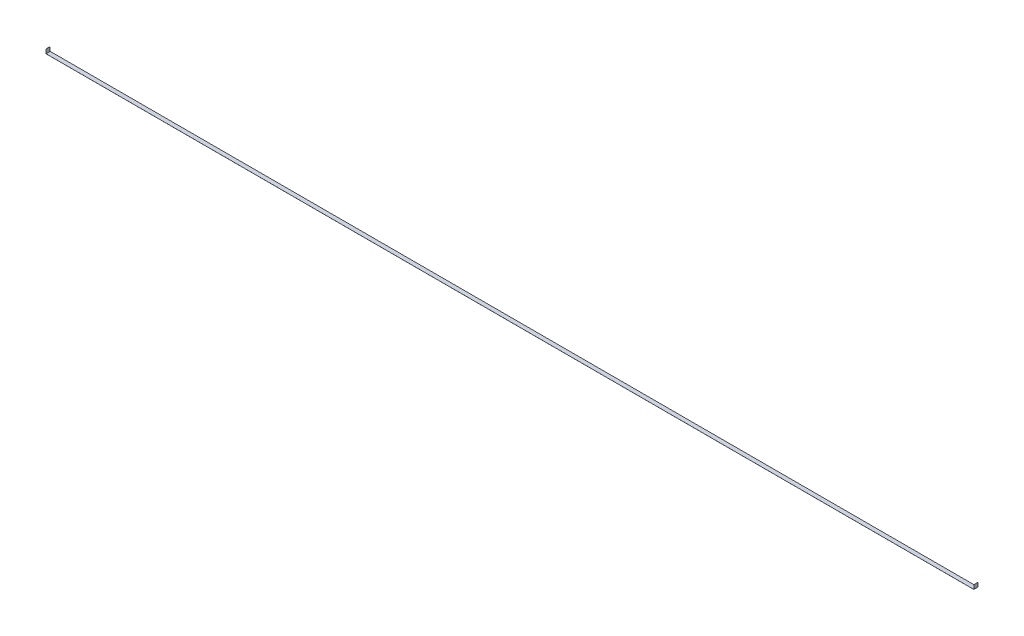
ISO-10303-21;
HEADER;
FILE_DESCRIPTION(('STEP AP214'),'2;1');
FILE_NAME('part.step','',(''),(''),'','','');
FILE_SCHEMA(('AUTOMOTIVE_DESIGN { 1 0 10303 214 1 1 1 1 }'));
ENDSEC;
DATA;
#1=APPLICATION_CONTEXT('core data for automotive mechanical design processes');
#2=APPLICATION_PROTOCOL_DEFINITION('international standard','automotive_design',2000,#1);
#3=PRODUCT_CONTEXT('',#1,'mechanical');
#4=PRODUCT('Part','Part','',(#3));
#5=PRODUCT_RELATED_PRODUCT_CATEGORY('part','',(#4));
#6=PRODUCT_DEFINITION_FORMATION('','',#4);
#7=PRODUCT_DEFINITION_CONTEXT('part definition',#1,'design');
#8=PRODUCT_DEFINITION('design','',#6,#7);
#9=PRODUCT_DEFINITION_SHAPE('','',#8);
#10=(LENGTH_UNIT() NAMED_UNIT(*) SI_UNIT(.MILLI.,.METRE.));
#11=(NAMED_UNIT(*) PLANE_ANGLE_UNIT() SI_UNIT($,.RADIAN.));
#12=(NAMED_UNIT(*) SI_UNIT($,.STERADIAN.) SOLID_ANGLE_UNIT());
#13=UNCERTAINTY_MEASURE_WITH_UNIT(LENGTH_MEASURE(1.E-05),#10,'distance_accuracy_value','');
#14=(GEOMETRIC_REPRESENTATION_CONTEXT(3) GLOBAL_UNCERTAINTY_ASSIGNED_CONTEXT((#13)) GLOBAL_UNIT_ASSIGNED_CONTEXT((#10,
#11,#12)) REPRESENTATION_CONTEXT('',''));
#15=CARTESIAN_POINT('',(0.,0.,0.));
#16=DIRECTION('',(0.,0.,1.));
#17=DIRECTION('',(1.,0.,0.));
#18=AXIS2_PLACEMENT_3D('',#15,#16,#17);
#19=CARTESIAN_POINT('',(2832.354,1.04049665995957E-12,12.7));
#20=DIRECTION('',(-1.,0.,0.));
#21=DIRECTION('',(0.,0.,1.));
#22=AXIS2_PLACEMENT_3D('',#19,#20,#21);
#23=PLANE('',#22);
#24=DIRECTION('',(0.,1.,0.));
#25=VECTOR('',#24,1.);
#26=CARTESIAN_POINT('',(2832.354,1.04049665995957E-12,-12.7));
#27=LINE('',#26,#25);
#28=CARTESIAN_POINT('',(2832.354,-0.253999999998959,-12.7));
#29=VERTEX_POINT('',#28);
#30=CARTESIAN_POINT('',(2832.354,25.400000000001,-12.7));
#31=VERTEX_POINT('',#30);
#32=EDGE_CURVE('E134',#29,#31,#27,.T.);
#33=ORIENTED_EDGE('',*,*,#32,.T.);
#34=DIRECTION('',(0.,0.,-1.));
#35=VECTOR('',#34,1.);
#36=CARTESIAN_POINT('',(2832.354,25.400000000001,12.7));
#37=LINE('',#36,#35);
#38=CARTESIAN_POINT('',(2832.354,25.400000000001,12.7));
#39=VERTEX_POINT('',#38);
#40=EDGE_CURVE('E11',#39,#31,#37,.T.);
#41=ORIENTED_EDGE('',*,*,#40,.F.);
#42=DIRECTION('',(0.,1.,0.));
#43=VECTOR('',#42,1.);
#44=CARTESIAN_POINT('',(2832.354,1.04049665995957E-12,12.7));
#45=LINE('',#44,#43);
#46=CARTESIAN_POINT('',(2832.354,-0.253999999998959,12.7));
#47=VERTEX_POINT('',#46);
#48=EDGE_CURVE('E92',#47,#39,#45,.T.);
#49=ORIENTED_EDGE('',*,*,#48,.F.);
#50=DIRECTION('',(0.,0.,-1.));
#51=VECTOR('',#50,1.);
#52=CARTESIAN_POINT('',(2832.354,-0.253999999998959,12.7));
#53=LINE('',#52,#51);
#54=EDGE_CURVE('E133',#47,#29,#53,.T.);
#55=ORIENTED_EDGE('',*,*,#54,.T.);
#56=EDGE_LOOP('',(#33,#41,#49,#55));
#57=FACE_BOUND('',#56,.T.);
#58=ADVANCED_FACE('F37',(#57),#23,.F.);
#59=CARTESIAN_POINT('',(2832.1,25.400000000001,12.7));
#60=DIRECTION('',(0.,1.,0.));
#61=DIRECTION('',(0.,0.,1.));
#62=AXIS2_PLACEMENT_3D('',#59,#60,#61);
#63=PLANE('',#62);
#64=DIRECTION('',(1.,0.,0.));
#65=VECTOR('',#64,1.);
#66=CARTESIAN_POINT('',(2832.1,25.400000000001,-12.7));
#67=LINE('',#66,#65);
#68=CARTESIAN_POINT('',(2832.1,25.400000000001,-12.7));
#69=VERTEX_POINT('',#68);
#70=EDGE_CURVE('E137',#69,#31,#67,.T.);
#71=ORIENTED_EDGE('',*,*,#70,.F.);
#72=DIRECTION('',(0.,0.,-1.));
#73=VECTOR('',#72,1.);
#74=CARTESIAN_POINT('',(2832.1,25.400000000001,12.7));
#75=LINE('',#74,#73);
#76=CARTESIAN_POINT('',(2832.1,25.400000000001,12.7));
#77=VERTEX_POINT('',#76);
#78=EDGE_CURVE('E45',#77,#69,#75,.T.);
#79=ORIENTED_EDGE('',*,*,#78,.F.);
#80=DIRECTION('',(1.,0.,0.));
#81=VECTOR('',#80,1.);
#82=CARTESIAN_POINT('',(2832.1,25.400000000001,12.7));
#83=LINE('',#82,#81);
#84=EDGE_CURVE('E176',#77,#39,#83,.T.);
#85=ORIENTED_EDGE('',*,*,#84,.T.);
#86=ORIENTED_EDGE('',*,*,#40,.T.);
#87=EDGE_LOOP('',(#71,#79,#85,#86));
#88=FACE_BOUND('',#87,.T.);
#89=ADVANCED_FACE('F167',(#88),#63,.T.);
#90=CARTESIAN_POINT('',(2832.1,1.04049665995957E-12,12.7));
#91=DIRECTION('',(-1.,0.,0.));
#92=DIRECTION('',(0.,0.,1.));
#93=AXIS2_PLACEMENT_3D('',#90,#91,#92);
#94=PLANE('',#93);
#95=DIRECTION('',(0.,1.,0.));
#96=VECTOR('',#95,1.);
#97=CARTESIAN_POINT('',(2832.1,1.04049665995957E-12,-12.7));
#98=LINE('',#97,#96);
#99=CARTESIAN_POINT('',(2832.1,1.04049665995957E-12,-12.7));
#100=VERTEX_POINT('',#99);
#101=EDGE_CURVE('E140',#100,#69,#98,.T.);
#102=ORIENTED_EDGE('',*,*,#101,.F.);
#103=DIRECTION('',(0.,0.,-1.));
#104=VECTOR('',#103,1.);
#105=CARTESIAN_POINT('',(2832.1,1.04049665995957E-12,12.7));
#106=LINE('',#105,#104);
#107=CARTESIAN_POINT('',(2832.1,1.04049665995957E-12,12.7));
#108=VERTEX_POINT('',#107);
#109=EDGE_CURVE('E157',#108,#100,#106,.T.);
#110=ORIENTED_EDGE('',*,*,#109,.F.);
#111=DIRECTION('',(0.,1.,0.));
#112=VECTOR('',#111,1.);
#113=CARTESIAN_POINT('',(2832.1,1.04049665995957E-12,12.7));
#114=LINE('',#113,#112);
#115=EDGE_CURVE('E164',#108,#77,#114,.T.);
#116=ORIENTED_EDGE('',*,*,#115,.T.);
#117=ORIENTED_EDGE('',*,*,#78,.T.);
#118=EDGE_LOOP('',(#102,#110,#116,#117));
#119=FACE_BOUND('',#118,.T.);
#120=ADVANCED_FACE('F162',(#119),#94,.T.);
#121=CARTESIAN_POINT('',(-2832.1,0.,12.7));
#122=DIRECTION('',(0.,1.,0.));
#123=DIRECTION('',(-1.,0.,0.));
#124=AXIS2_PLACEMENT_3D('',#121,#122,#123);
#125=PLANE('',#124);
#126=DIRECTION('',(1.,0.,0.));
#127=VECTOR('',#126,1.);
#128=CARTESIAN_POINT('',(-2832.1,0.,-12.7));
#129=LINE('',#128,#127);
#130=CARTESIAN_POINT('',(-2832.1,0.,-12.7));
#131=VERTEX_POINT('',#130);
#132=EDGE_CURVE('E143',#131,#100,#129,.T.);
#133=ORIENTED_EDGE('',*,*,#132,.F.);
#134=DIRECTION('',(0.,0.,-1.));
#135=VECTOR('',#134,1.);
#136=CARTESIAN_POINT('',(-2832.1,0.,12.7));
#137=LINE('',#136,#135);
#138=CARTESIAN_POINT('',(-2832.1,0.,12.7));
#139=VERTEX_POINT('',#138);
#140=EDGE_CURVE('E155',#139,#131,#137,.T.);
#141=ORIENTED_EDGE('',*,*,#140,.F.);
#142=DIRECTION('',(1.,0.,0.));
#143=VECTOR('',#142,1.);
#144=CARTESIAN_POINT('',(-2832.1,0.,12.7));
#145=LINE('',#144,#143);
#146=EDGE_CURVE('E128',#139,#108,#145,.T.);
#147=ORIENTED_EDGE('',*,*,#146,.T.);
#148=ORIENTED_EDGE('',*,*,#109,.T.);
#149=EDGE_LOOP('',(#133,#141,#147,#148));
#150=FACE_BOUND('',#149,.T.);
#151=ADVANCED_FACE('F174',(#150),#125,.T.);
#152=CARTESIAN_POINT('',(-2832.1,25.4,12.7));
#153=DIRECTION('',(1.,0.,0.));
#154=DIRECTION('',(0.,0.,-1.));
#155=AXIS2_PLACEMENT_3D('',#152,#153,#154);
#156=PLANE('',#155);
#157=DIRECTION('',(0.,-1.,0.));
#158=VECTOR('',#157,1.);
#159=CARTESIAN_POINT('',(-2832.1,25.4,-12.7));
#160=LINE('',#159,#158);
#161=CARTESIAN_POINT('',(-2832.1,25.4,-12.7));
#162=VERTEX_POINT('',#161);
#163=EDGE_CURVE('E146',#162,#131,#160,.T.);
#164=ORIENTED_EDGE('',*,*,#163,.F.);
#165=DIRECTION('',(0.,0.,-1.));
#166=VECTOR('',#165,1.);
#167=CARTESIAN_POINT('',(-2832.1,25.4,12.7));
#168=LINE('',#167,#166);
#169=CARTESIAN_POINT('',(-2832.1,25.4,12.7));
#170=VERTEX_POINT('',#169);
#171=EDGE_CURVE('E116',#170,#162,#168,.T.);
#172=ORIENTED_EDGE('',*,*,#171,.F.);
#173=DIRECTION('',(0.,-1.,0.));
#174=VECTOR('',#173,1.);
#175=CARTESIAN_POINT('',(-2832.1,25.4,12.7));
#176=LINE('',#175,#174);
#177=EDGE_CURVE('E126',#170,#139,#176,.T.);
#178=ORIENTED_EDGE('',*,*,#177,.T.);
#179=ORIENTED_EDGE('',*,*,#140,.T.);
#180=EDGE_LOOP('',(#164,#172,#178,#179));
#181=FACE_BOUND('',#180,.T.);
#182=ADVANCED_FACE('F181',(#181),#156,.T.);
#183=CARTESIAN_POINT('',(-2832.354,25.4,12.7));
#184=DIRECTION('',(0.,1.,0.));
#185=DIRECTION('',(0.,0.,1.));
#186=AXIS2_PLACEMENT_3D('',#183,#184,#185);
#187=PLANE('',#186);
#188=DIRECTION('',(1.,0.,0.));
#189=VECTOR('',#188,1.);
#190=CARTESIAN_POINT('',(-2832.354,25.4,-12.7));
#191=LINE('',#190,#189);
#192=CARTESIAN_POINT('',(-2832.354,25.4,-12.7));
#193=VERTEX_POINT('',#192);
#194=EDGE_CURVE('E115',#193,#162,#191,.T.);
#195=ORIENTED_EDGE('',*,*,#194,.F.);
#196=DIRECTION('',(0.,0.,-1.));
#197=VECTOR('',#196,1.);
#198=CARTESIAN_POINT('',(-2832.354,25.4,12.7));
#199=LINE('',#198,#197);
#200=CARTESIAN_POINT('',(-2832.354,25.4,12.7));
#201=VERTEX_POINT('',#200);
#202=EDGE_CURVE('E109',#201,#193,#199,.T.);
#203=ORIENTED_EDGE('',*,*,#202,.F.);
#204=DIRECTION('',(1.,0.,0.));
#205=VECTOR('',#204,1.);
#206=CARTESIAN_POINT('',(-2832.354,25.4,12.7));
#207=LINE('',#206,#205);
#208=EDGE_CURVE('E113',#201,#170,#207,.T.);
#209=ORIENTED_EDGE('',*,*,#208,.T.);
#210=ORIENTED_EDGE('',*,*,#171,.T.);
#211=EDGE_LOOP('',(#195,#203,#209,#210));
#212=FACE_BOUND('',#211,.T.);
#213=ADVANCED_FACE('F111',(#212),#187,.T.);
#214=CARTESIAN_POINT('',(-2832.354,25.4,12.7));
#215=DIRECTION('',(1.,0.,0.));
#216=DIRECTION('',(0.,0.,-1.));
#217=AXIS2_PLACEMENT_3D('',#214,#215,#216);
#218=PLANE('',#217);
#219=DIRECTION('',(0.,1.,0.));
#220=VECTOR('',#219,1.);
#221=CARTESIAN_POINT('',(-2832.354,25.4,-12.7));
#222=LINE('',#221,#220);
#223=CARTESIAN_POINT('',(-2832.354,-0.254,-12.7));
#224=VERTEX_POINT('',#223);
#225=EDGE_CURVE('E80',#193,#224,#222,.F.);
#226=ORIENTED_EDGE('',*,*,#225,.T.);
#227=DIRECTION('',(0.,0.,-1.));
#228=VECTOR('',#227,1.);
#229=CARTESIAN_POINT('',(-2832.354,-0.254,12.7));
#230=LINE('',#229,#228);
#231=CARTESIAN_POINT('',(-2832.354,-0.254,12.7));
#232=VERTEX_POINT('',#231);
#233=EDGE_CURVE('E117',#232,#224,#230,.T.);
#234=ORIENTED_EDGE('',*,*,#233,.F.);
#235=DIRECTION('',(0.,1.,0.));
#236=VECTOR('',#235,1.);
#237=CARTESIAN_POINT('',(-2832.354,25.4,12.7));
#238=LINE('',#237,#236);
#239=EDGE_CURVE('E119',#201,#232,#238,.F.);
#240=ORIENTED_EDGE('',*,*,#239,.F.);
#241=ORIENTED_EDGE('',*,*,#202,.T.);
#242=EDGE_LOOP('',(#226,#234,#240,#241));
#243=FACE_BOUND('',#242,.T.);
#244=ADVANCED_FACE('F120',(#243),#218,.F.);
#245=CARTESIAN_POINT('',(-2832.1,-0.254,12.7));
#246=DIRECTION('',(0.,1.,0.));
#247=DIRECTION('',(-1.,0.,0.));
#248=AXIS2_PLACEMENT_3D('',#245,#246,#247);
#249=PLANE('',#248);
#250=DIRECTION('',(1.,0.,0.));
#251=VECTOR('',#250,1.);
#252=CARTESIAN_POINT('',(-2832.1,-0.254,-12.7));
#253=LINE('',#252,#251);
#254=EDGE_CURVE('E86',#224,#29,#253,.T.);
#255=ORIENTED_EDGE('',*,*,#254,.T.);
#256=ORIENTED_EDGE('',*,*,#54,.F.);
#257=DIRECTION('',(1.,0.,0.));
#258=VECTOR('',#257,1.);
#259=CARTESIAN_POINT('',(-2832.1,-0.254,12.7));
#260=LINE('',#259,#258);
#261=EDGE_CURVE('E53',#232,#47,#260,.T.);
#262=ORIENTED_EDGE('',*,*,#261,.F.);
#263=ORIENTED_EDGE('',*,*,#233,.T.);
#264=EDGE_LOOP('',(#255,#256,#262,#263));
#265=FACE_BOUND('',#264,.T.);
#266=ADVANCED_FACE('F183',(#265),#249,.F.);
#267=CARTESIAN_POINT('',(0.,0.,12.7));
#268=DIRECTION('',(0.,0.,-1.));
#269=DIRECTION('',(-1.,0.,0.));
#270=AXIS2_PLACEMENT_3D('',#267,#268,#269);
#271=PLANE('',#270);
#272=ORIENTED_EDGE('',*,*,#48,.T.);
#273=ORIENTED_EDGE('',*,*,#84,.F.);
#274=ORIENTED_EDGE('',*,*,#115,.F.);
#275=ORIENTED_EDGE('',*,*,#146,.F.);
#276=ORIENTED_EDGE('',*,*,#177,.F.);
#277=ORIENTED_EDGE('',*,*,#208,.F.);
#278=ORIENTED_EDGE('',*,*,#239,.T.);
#279=ORIENTED_EDGE('',*,*,#261,.T.);
#280=EDGE_LOOP('',(#272,#273,#274,#275,#276,#277,#278,#279));
#281=FACE_BOUND('',#280,.T.);
#282=ADVANCED_FACE('F123',(#281),#271,.F.);
#283=CARTESIAN_POINT('',(0.,0.,-12.7));
#284=DIRECTION('',(0.,0.,-1.));
#285=DIRECTION('',(-1.,0.,0.));
#286=AXIS2_PLACEMENT_3D('',#283,#284,#285);
#287=PLANE('',#286);
#288=ORIENTED_EDGE('',*,*,#32,.F.);
#289=ORIENTED_EDGE('',*,*,#254,.F.);
#290=ORIENTED_EDGE('',*,*,#225,.F.);
#291=ORIENTED_EDGE('',*,*,#194,.T.);
#292=ORIENTED_EDGE('',*,*,#163,.T.);
#293=ORIENTED_EDGE('',*,*,#132,.T.);
#294=ORIENTED_EDGE('',*,*,#101,.T.);
#295=ORIENTED_EDGE('',*,*,#70,.T.);
#296=EDGE_LOOP('',(#288,#289,#290,#291,#292,#293,#294,#295));
#297=FACE_BOUND('',#296,.T.);
#298=ADVANCED_FACE('F170',(#297),#287,.T.);
#299=CLOSED_SHELL('',(#58,#89,#120,#151,#182,#213,#244,#266,#282,#298));
#300=MANIFOLD_SOLID_BREP('B2',#299);
#301=ADVANCED_BREP_SHAPE_REPRESENTATION('',(#18,#300),#14);
#302=SHAPE_DEFINITION_REPRESENTATION(#9,#301);
ENDSEC;
END-ISO-10303-21;
